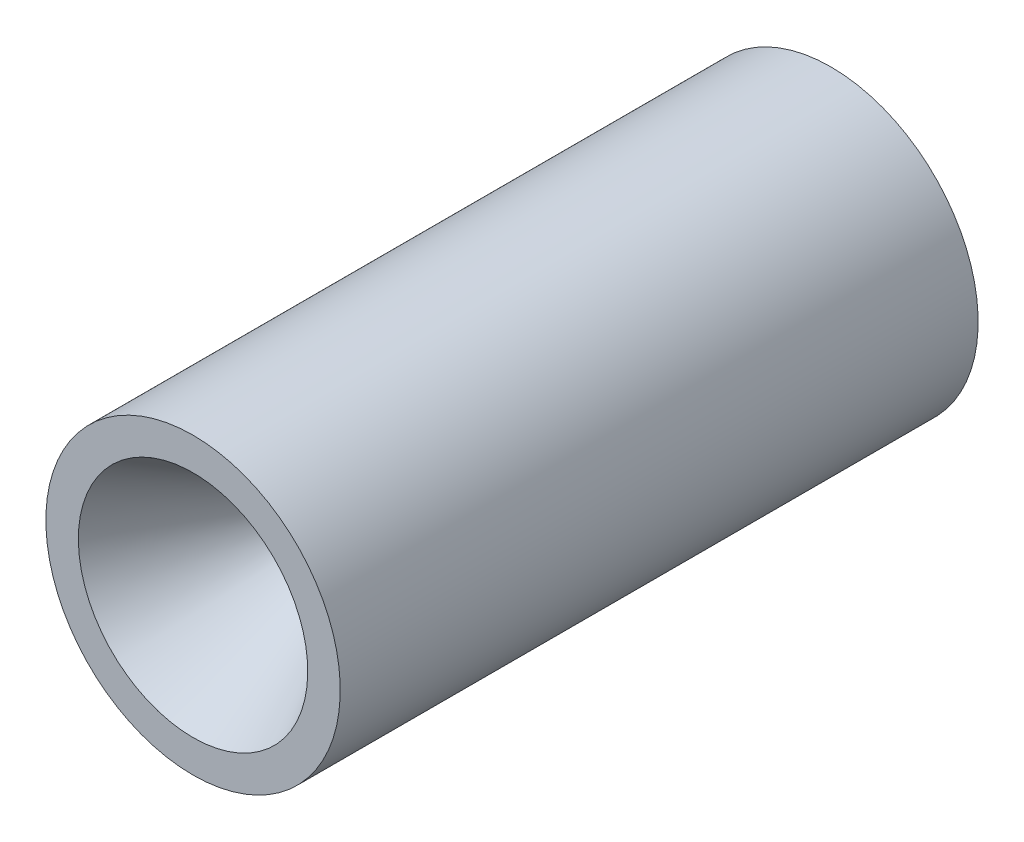
ISO-10303-21;
HEADER;
FILE_DESCRIPTION(('STEP AP214'),'2;1');
FILE_NAME('part.step','',(''),(''),'','','');
FILE_SCHEMA(('AUTOMOTIVE_DESIGN { 1 0 10303 214 1 1 1 1 }'));
ENDSEC;
DATA;
#1=APPLICATION_CONTEXT('core data for automotive mechanical design processes');
#2=APPLICATION_PROTOCOL_DEFINITION('international standard','automotive_design',2000,#1);
#3=PRODUCT_CONTEXT('',#1,'mechanical');
#4=PRODUCT('Part','Part','',(#3));
#5=PRODUCT_RELATED_PRODUCT_CATEGORY('part','',(#4));
#6=PRODUCT_DEFINITION_FORMATION('','',#4);
#7=PRODUCT_DEFINITION_CONTEXT('part definition',#1,'design');
#8=PRODUCT_DEFINITION('design','',#6,#7);
#9=PRODUCT_DEFINITION_SHAPE('','',#8);
#10=(LENGTH_UNIT() NAMED_UNIT(*) SI_UNIT(.MILLI.,.METRE.));
#11=(NAMED_UNIT(*) PLANE_ANGLE_UNIT() SI_UNIT($,.RADIAN.));
#12=(NAMED_UNIT(*) SI_UNIT($,.STERADIAN.) SOLID_ANGLE_UNIT());
#13=UNCERTAINTY_MEASURE_WITH_UNIT(LENGTH_MEASURE(1.E-05),#10,'distance_accuracy_value','');
#14=(GEOMETRIC_REPRESENTATION_CONTEXT(3) GLOBAL_UNCERTAINTY_ASSIGNED_CONTEXT((#13)) GLOBAL_UNIT_ASSIGNED_CONTEXT((#10,
#11,#12)) REPRESENTATION_CONTEXT('',''));
#15=CARTESIAN_POINT('',(0.,0.,0.));
#16=DIRECTION('',(0.,0.,1.));
#17=DIRECTION('',(1.,0.,0.));
#18=AXIS2_PLACEMENT_3D('',#15,#16,#17);
#19=CARTESIAN_POINT('',(0.,38.1,62.9808611692183));
#20=DIRECTION('',(0.,0.,-1.));
#21=DIRECTION('',(0.,1.,0.));
#22=AXIS2_PLACEMENT_3D('',#19,#20,#21);
#23=PLANE('',#22);
#24=CARTESIAN_POINT('',(0.,0.,62.9808611692183));
#25=DIRECTION('',(0.,0.,1.));
#26=DIRECTION('',(0.,-1.,0.));
#27=AXIS2_PLACEMENT_3D('',#24,#25,#26);
#28=CIRCLE('',#27,29.6889581514477);
#29=CARTESIAN_POINT('',(0.,-29.6889581514477,62.9808611692183));
#30=VERTEX_POINT('',#29);
#31=EDGE_CURVE('E10',#30,#30,#28,.T.);
#32=ORIENTED_EDGE('',*,*,#31,.F.);
#33=EDGE_LOOP('',(#32));
#34=FACE_BOUND('',#33,.T.);
#35=CARTESIAN_POINT('',(0.,0.,62.9808611692183));
#36=DIRECTION('',(0.,0.,1.));
#37=DIRECTION('',(0.,-1.,0.));
#38=AXIS2_PLACEMENT_3D('',#35,#36,#37);
#39=CIRCLE('',#38,38.1);
#40=CARTESIAN_POINT('',(0.,-38.1,62.9808611692183));
#41=VERTEX_POINT('',#40);
#42=EDGE_CURVE('E53',#41,#41,#39,.T.);
#43=ORIENTED_EDGE('',*,*,#42,.T.);
#44=EDGE_LOOP('',(#43));
#45=FACE_BOUND('',#44,.T.);
#46=ADVANCED_FACE('F31',(#34,#45),#23,.F.);
#47=CARTESIAN_POINT('',(0.,0.,62.9808611692183));
#48=DIRECTION('',(0.,0.,1.));
#49=DIRECTION('',(0.,-1.,0.));
#50=AXIS2_PLACEMENT_3D('',#47,#48,#49);
#51=CONICAL_SURFACE('',#50,29.6889581514477,0.5235987755983);
#52=CARTESIAN_POINT('',(0.,0.,28.0558611692183));
#53=DIRECTION('',(0.,0.,1.));
#54=DIRECTION('',(0.,-1.,0.));
#55=AXIS2_PLACEMENT_3D('',#52,#53,#54);
#56=CIRCLE('',#55,9.52499999999999);
#57=CARTESIAN_POINT('',(0.,-9.52499999999998,28.0558611692183));
#58=VERTEX_POINT('',#57);
#59=EDGE_CURVE('E37',#58,#58,#56,.T.);
#60=ORIENTED_EDGE('',*,*,#59,.F.);
#61=EDGE_LOOP('',(#60));
#62=FACE_BOUND('',#61,.T.);
#63=ORIENTED_EDGE('',*,*,#31,.T.);
#64=EDGE_LOOP('',(#63));
#65=FACE_BOUND('',#64,.T.);
#66=ADVANCED_FACE('F78',(#62,#65),#51,.F.);
#67=CARTESIAN_POINT('',(0.,0.,62.9808611692183));
#68=DIRECTION('',(0.,0.,1.));
#69=DIRECTION('',(0.,-1.,0.));
#70=AXIS2_PLACEMENT_3D('',#67,#68,#69);
#71=CYLINDRICAL_SURFACE('',#70,9.52499999999999);
#72=CARTESIAN_POINT('',(0.,0.,24.8808611692183));
#73=DIRECTION('',(0.,0.,1.));
#74=DIRECTION('',(0.,-1.,0.));
#75=AXIS2_PLACEMENT_3D('',#72,#73,#74);
#76=CIRCLE('',#75,9.52499999999999);
#77=CARTESIAN_POINT('',(0.,-9.52499999999999,24.8808611692183));
#78=VERTEX_POINT('',#77);
#79=EDGE_CURVE('E41',#78,#78,#76,.T.);
#80=ORIENTED_EDGE('',*,*,#79,.F.);
#81=EDGE_LOOP('',(#80));
#82=FACE_BOUND('',#81,.T.);
#83=ORIENTED_EDGE('',*,*,#59,.T.);
#84=EDGE_LOOP('',(#83));
#85=FACE_BOUND('',#84,.T.);
#86=ADVANCED_FACE('F73',(#82,#85),#71,.F.);
#87=CARTESIAN_POINT('',(0.,0.,24.8808611692183));
#88=DIRECTION('',(0.,0.,-1.));
#89=DIRECTION('',(0.,1.,0.));
#90=AXIS2_PLACEMENT_3D('',#87,#88,#89);
#91=CONICAL_SURFACE('',#90,9.52499999999999,0.182931766234854);
#92=CARTESIAN_POINT('',(0.,0.,-102.119138830782));
#93=DIRECTION('',(0.,0.,1.));
#94=DIRECTION('',(0.,-1.,0.));
#95=AXIS2_PLACEMENT_3D('',#92,#93,#94);
#96=CIRCLE('',#95,33.02);
#97=CARTESIAN_POINT('',(0.,-33.0199999999999,-102.119138830782));
#98=VERTEX_POINT('',#97);
#99=EDGE_CURVE('E45',#98,#98,#96,.T.);
#100=ORIENTED_EDGE('',*,*,#99,.F.);
#101=EDGE_LOOP('',(#100));
#102=FACE_BOUND('',#101,.T.);
#103=ORIENTED_EDGE('',*,*,#79,.T.);
#104=EDGE_LOOP('',(#103));
#105=FACE_BOUND('',#104,.T.);
#106=ADVANCED_FACE('F67',(#102,#105),#91,.F.);
#107=CARTESIAN_POINT('',(0.,33.02,-102.119138830782));
#108=DIRECTION('',(0.,0.,1.));
#109=DIRECTION('',(0.,-1.,0.));
#110=AXIS2_PLACEMENT_3D('',#107,#108,#109);
#111=PLANE('',#110);
#112=CARTESIAN_POINT('',(0.,0.,-102.119138830782));
#113=DIRECTION('',(0.,0.,1.));
#114=DIRECTION('',(0.,-1.,0.));
#115=AXIS2_PLACEMENT_3D('',#112,#113,#114);
#116=CIRCLE('',#115,38.1);
#117=CARTESIAN_POINT('',(0.,-38.0999999999999,-102.119138830782));
#118=VERTEX_POINT('',#117);
#119=EDGE_CURVE('E50',#118,#118,#116,.T.);
#120=ORIENTED_EDGE('',*,*,#119,.F.);
#121=EDGE_LOOP('',(#120));
#122=FACE_BOUND('',#121,.T.);
#123=ORIENTED_EDGE('',*,*,#99,.T.);
#124=EDGE_LOOP('',(#123));
#125=FACE_BOUND('',#124,.T.);
#126=ADVANCED_FACE('F61',(#122,#125),#111,.F.);
#127=CARTESIAN_POINT('',(0.,0.,62.9808611692183));
#128=DIRECTION('',(0.,0.,1.));
#129=DIRECTION('',(0.,-1.,0.));
#130=AXIS2_PLACEMENT_3D('',#127,#128,#129);
#131=CYLINDRICAL_SURFACE('',#130,38.1);
#132=ORIENTED_EDGE('',*,*,#42,.F.);
#133=EDGE_LOOP('',(#132));
#134=FACE_BOUND('',#133,.T.);
#135=ORIENTED_EDGE('',*,*,#119,.T.);
#136=EDGE_LOOP('',(#135));
#137=FACE_BOUND('',#136,.T.);
#138=ADVANCED_FACE('F58',(#134,#137),#131,.T.);
#139=CLOSED_SHELL('',(#46,#66,#86,#106,#126,#138));
#140=MANIFOLD_SOLID_BREP('B2',#139);
#141=ADVANCED_BREP_SHAPE_REPRESENTATION('',(#18,#140),#14);
#142=SHAPE_DEFINITION_REPRESENTATION(#9,#141);
ENDSEC;
END-ISO-10303-21;
